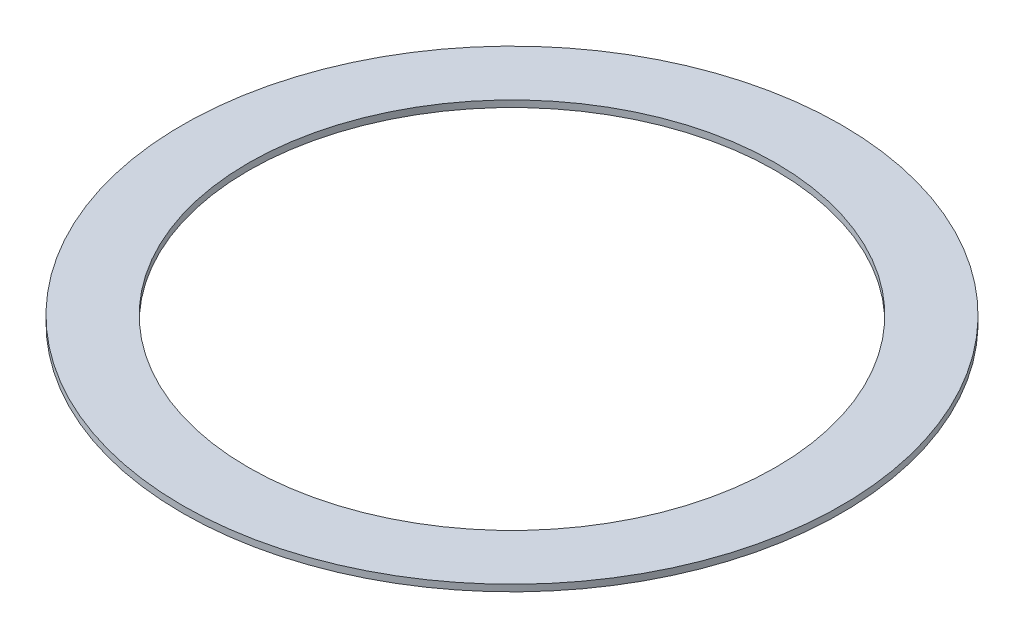
ISO-10303-21;
HEADER;
FILE_DESCRIPTION(('STEP AP214'),'2;1');
FILE_NAME('part.step','',(''),(''),'','','');
FILE_SCHEMA(('AUTOMOTIVE_DESIGN { 1 0 10303 214 1 1 1 1 }'));
ENDSEC;
DATA;
#1=APPLICATION_CONTEXT('core data for automotive mechanical design processes');
#2=APPLICATION_PROTOCOL_DEFINITION('international standard','automotive_design',2000,#1);
#3=PRODUCT_CONTEXT('',#1,'mechanical');
#4=PRODUCT('Part','Part','',(#3));
#5=PRODUCT_RELATED_PRODUCT_CATEGORY('part','',(#4));
#6=PRODUCT_DEFINITION_FORMATION('','',#4);
#7=PRODUCT_DEFINITION_CONTEXT('part definition',#1,'design');
#8=PRODUCT_DEFINITION('design','',#6,#7);
#9=PRODUCT_DEFINITION_SHAPE('','',#8);
#10=(LENGTH_UNIT() NAMED_UNIT(*) SI_UNIT(.MILLI.,.METRE.));
#11=(NAMED_UNIT(*) PLANE_ANGLE_UNIT() SI_UNIT($,.RADIAN.));
#12=(NAMED_UNIT(*) SI_UNIT($,.STERADIAN.) SOLID_ANGLE_UNIT());
#13=UNCERTAINTY_MEASURE_WITH_UNIT(LENGTH_MEASURE(1.E-05),#10,'distance_accuracy_value','');
#14=(GEOMETRIC_REPRESENTATION_CONTEXT(3) GLOBAL_UNCERTAINTY_ASSIGNED_CONTEXT((#13)) GLOBAL_UNIT_ASSIGNED_CONTEXT((#10,
#11,#12)) REPRESENTATION_CONTEXT('',''));
#15=CARTESIAN_POINT('',(0.,0.,0.));
#16=DIRECTION('',(0.,0.,1.));
#17=DIRECTION('',(1.,0.,0.));
#18=AXIS2_PLACEMENT_3D('',#15,#16,#17);
#19=CARTESIAN_POINT('',(0.,-5.,0.));
#20=DIRECTION('',(0.,1.,0.));
#21=DIRECTION('',(0.,0.,1.));
#22=AXIS2_PLACEMENT_3D('',#19,#20,#21);
#23=CYLINDRICAL_SURFACE('',#22,250.);
#24=CARTESIAN_POINT('',(0.,-5.,0.));
#25=DIRECTION('',(0.,1.,0.));
#26=DIRECTION('',(0.,0.,1.));
#27=AXIS2_PLACEMENT_3D('',#24,#25,#26);
#28=CIRCLE('',#27,250.);
#29=CARTESIAN_POINT('',(0.,-5.,250.));
#30=VERTEX_POINT('',#29);
#31=EDGE_CURVE('E10',#30,#30,#28,.T.);
#32=ORIENTED_EDGE('',*,*,#31,.T.);
#33=EDGE_LOOP('',(#32));
#34=FACE_BOUND('',#33,.T.);
#35=CARTESIAN_POINT('',(0.,0.,0.));
#36=DIRECTION('',(0.,1.,0.));
#37=DIRECTION('',(0.,0.,1.));
#38=AXIS2_PLACEMENT_3D('',#35,#36,#37);
#39=CIRCLE('',#38,250.);
#40=CARTESIAN_POINT('',(0.,0.,250.));
#41=VERTEX_POINT('',#40);
#42=EDGE_CURVE('E39',#41,#41,#39,.T.);
#43=ORIENTED_EDGE('',*,*,#42,.F.);
#44=EDGE_LOOP('',(#43));
#45=FACE_BOUND('',#44,.T.);
#46=ADVANCED_FACE('F36',(#34,#45),#23,.T.);
#47=CARTESIAN_POINT('',(0.,-5.,0.));
#48=DIRECTION('',(0.,1.,0.));
#49=DIRECTION('',(0.,0.,1.));
#50=AXIS2_PLACEMENT_3D('',#47,#48,#49);
#51=PLANE('',#50);
#52=CARTESIAN_POINT('',(0.,-5.,0.));
#53=DIRECTION('',(0.,1.,0.));
#54=DIRECTION('',(0.,0.,1.));
#55=AXIS2_PLACEMENT_3D('',#52,#53,#54);
#56=CIRCLE('',#55,200.);
#57=CARTESIAN_POINT('',(0.,-5.,200.));
#58=VERTEX_POINT('',#57);
#59=EDGE_CURVE('E46',#58,#58,#56,.T.);
#60=ORIENTED_EDGE('',*,*,#59,.T.);
#61=EDGE_LOOP('',(#60));
#62=FACE_BOUND('',#61,.T.);
#63=ORIENTED_EDGE('',*,*,#31,.F.);
#64=EDGE_LOOP('',(#63));
#65=FACE_BOUND('',#64,.T.);
#66=ADVANCED_FACE('F54',(#62,#65),#51,.F.);
#67=CARTESIAN_POINT('',(0.,0.,0.));
#68=DIRECTION('',(0.,1.,0.));
#69=DIRECTION('',(0.,0.,1.));
#70=AXIS2_PLACEMENT_3D('',#67,#68,#69);
#71=PLANE('',#70);
#72=CARTESIAN_POINT('',(0.,0.,0.));
#73=DIRECTION('',(0.,1.,0.));
#74=DIRECTION('',(0.,0.,1.));
#75=AXIS2_PLACEMENT_3D('',#72,#73,#74);
#76=CIRCLE('',#75,200.);
#77=CARTESIAN_POINT('',(0.,0.,200.));
#78=VERTEX_POINT('',#77);
#79=EDGE_CURVE('E48',#78,#78,#76,.T.);
#80=ORIENTED_EDGE('',*,*,#79,.F.);
#81=EDGE_LOOP('',(#80));
#82=FACE_BOUND('',#81,.T.);
#83=ORIENTED_EDGE('',*,*,#42,.T.);
#84=EDGE_LOOP('',(#83));
#85=FACE_BOUND('',#84,.T.);
#86=ADVANCED_FACE('F60',(#82,#85),#71,.T.);
#87=CARTESIAN_POINT('',(0.,-5.,0.));
#88=DIRECTION('',(0.,1.,0.));
#89=DIRECTION('',(0.,0.,1.));
#90=AXIS2_PLACEMENT_3D('',#87,#88,#89);
#91=CYLINDRICAL_SURFACE('',#90,200.);
#92=ORIENTED_EDGE('',*,*,#59,.F.);
#93=EDGE_LOOP('',(#92));
#94=FACE_BOUND('',#93,.T.);
#95=ORIENTED_EDGE('',*,*,#79,.T.);
#96=EDGE_LOOP('',(#95));
#97=FACE_BOUND('',#96,.T.);
#98=ADVANCED_FACE('F57',(#94,#97),#91,.F.);
#99=CLOSED_SHELL('',(#46,#66,#86,#98));
#100=MANIFOLD_SOLID_BREP('B2',#99);
#101=ADVANCED_BREP_SHAPE_REPRESENTATION('',(#18,#100),#14);
#102=SHAPE_DEFINITION_REPRESENTATION(#9,#101);
ENDSEC;
END-ISO-10303-21;
